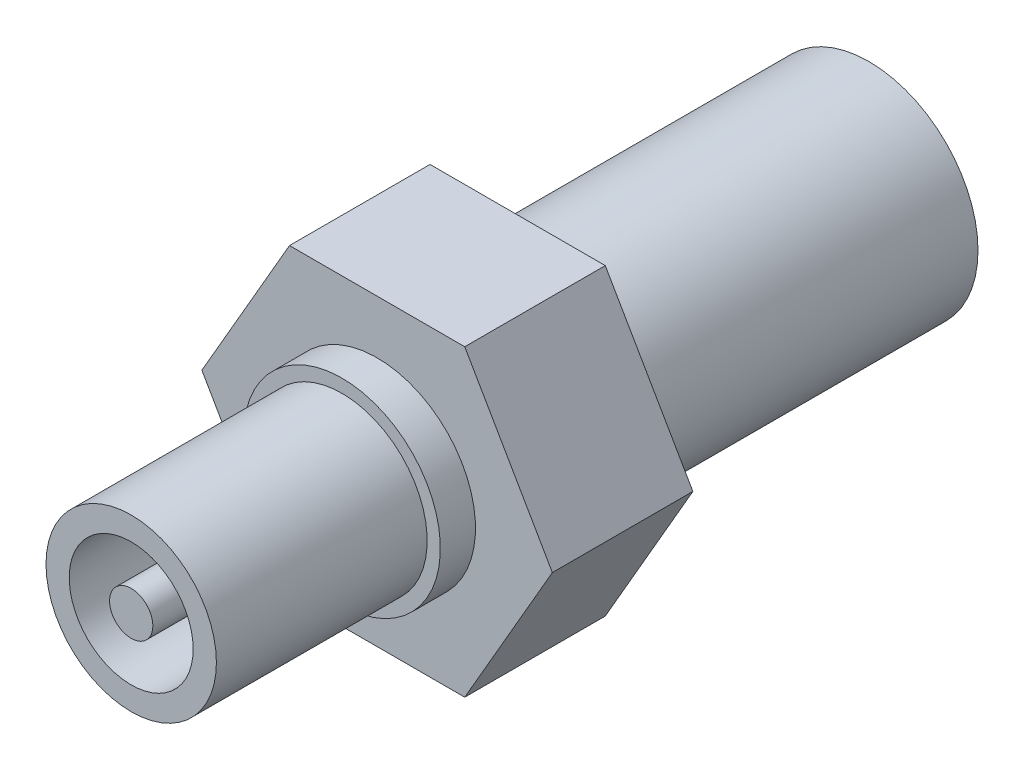
ISO-10303-21;
HEADER;
FILE_DESCRIPTION(('STEP AP214'),'2;1');
FILE_NAME('part.step','',(''),(''),'','','');
FILE_SCHEMA(('AUTOMOTIVE_DESIGN { 1 0 10303 214 1 1 1 1 }'));
ENDSEC;
DATA;
#1=APPLICATION_CONTEXT('core data for automotive mechanical design processes');
#2=APPLICATION_PROTOCOL_DEFINITION('international standard','automotive_design',2000,#1);
#3=PRODUCT_CONTEXT('',#1,'mechanical');
#4=PRODUCT('Part','Part','',(#3));
#5=PRODUCT_RELATED_PRODUCT_CATEGORY('part','',(#4));
#6=PRODUCT_DEFINITION_FORMATION('','',#4);
#7=PRODUCT_DEFINITION_CONTEXT('part definition',#1,'design');
#8=PRODUCT_DEFINITION('design','',#6,#7);
#9=PRODUCT_DEFINITION_SHAPE('','',#8);
#10=(LENGTH_UNIT() NAMED_UNIT(*) SI_UNIT(.MILLI.,.METRE.));
#11=(NAMED_UNIT(*) PLANE_ANGLE_UNIT() SI_UNIT($,.RADIAN.));
#12=(NAMED_UNIT(*) SI_UNIT($,.STERADIAN.) SOLID_ANGLE_UNIT());
#13=UNCERTAINTY_MEASURE_WITH_UNIT(LENGTH_MEASURE(1.E-05),#10,'distance_accuracy_value','');
#14=(GEOMETRIC_REPRESENTATION_CONTEXT(3) GLOBAL_UNCERTAINTY_ASSIGNED_CONTEXT((#13)) GLOBAL_UNIT_ASSIGNED_CONTEXT((#10,
#11,#12)) REPRESENTATION_CONTEXT('',''));
#15=CARTESIAN_POINT('',(0.,0.,0.));
#16=DIRECTION('',(0.,0.,1.));
#17=DIRECTION('',(1.,0.,0.));
#18=AXIS2_PLACEMENT_3D('',#15,#16,#17);
#19=CARTESIAN_POINT('',(3.95946814610245,6.858,-7.9375));
#20=DIRECTION('',(0.,0.,1.));
#21=DIRECTION('',(1.,0.,0.));
#22=AXIS2_PLACEMENT_3D('',#19,#20,#21);
#23=PLANE('',#22);
#24=DIRECTION('',(0.5,-0.866025403784439,0.));
#25=VECTOR('',#24,1.);
#26=CARTESIAN_POINT('',(7.91893629220491,0.,-7.9375));
#27=LINE('',#26,#25);
#28=CARTESIAN_POINT('',(3.95946814610245,6.858,-7.9375));
#29=VERTEX_POINT('',#28);
#30=CARTESIAN_POINT('',(7.91893629220491,0.,-7.9375));
#31=VERTEX_POINT('',#30);
#32=EDGE_CURVE('E124',#29,#31,#27,.T.);
#33=ORIENTED_EDGE('',*,*,#32,.T.);
#34=DIRECTION('',(-0.5,-0.866025403784439,0.));
#35=VECTOR('',#34,1.);
#36=CARTESIAN_POINT('',(3.95946814610245,-6.858,-7.9375));
#37=LINE('',#36,#35);
#38=CARTESIAN_POINT('',(3.95946814610245,-6.858,-7.9375));
#39=VERTEX_POINT('',#38);
#40=EDGE_CURVE('E101',#31,#39,#37,.T.);
#41=ORIENTED_EDGE('',*,*,#40,.T.);
#42=DIRECTION('',(-1.,0.,0.));
#43=VECTOR('',#42,1.);
#44=CARTESIAN_POINT('',(-3.95946814610245,-6.858,-7.9375));
#45=LINE('',#44,#43);
#46=CARTESIAN_POINT('',(-3.95946814610245,-6.858,-7.9375));
#47=VERTEX_POINT('',#46);
#48=EDGE_CURVE('E127',#39,#47,#45,.T.);
#49=ORIENTED_EDGE('',*,*,#48,.T.);
#50=DIRECTION('',(-0.5,0.866025403784439,0.));
#51=VECTOR('',#50,1.);
#52=CARTESIAN_POINT('',(-7.91893629220491,0.,-7.9375));
#53=LINE('',#52,#51);
#54=CARTESIAN_POINT('',(-7.91893629220491,0.,-7.9375));
#55=VERTEX_POINT('',#54);
#56=EDGE_CURVE('E129',#47,#55,#53,.T.);
#57=ORIENTED_EDGE('',*,*,#56,.T.);
#58=DIRECTION('',(0.5,0.866025403784439,0.));
#59=VECTOR('',#58,1.);
#60=CARTESIAN_POINT('',(-3.95946814610246,6.858,-7.9375));
#61=LINE('',#60,#59);
#62=CARTESIAN_POINT('',(-3.95946814610246,6.858,-7.9375));
#63=VERTEX_POINT('',#62);
#64=EDGE_CURVE('E52',#55,#63,#61,.T.);
#65=ORIENTED_EDGE('',*,*,#64,.T.);
#66=DIRECTION('',(1.,0.,0.));
#67=VECTOR('',#66,1.);
#68=CARTESIAN_POINT('',(3.95946814610245,6.858,-7.9375));
#69=LINE('',#68,#67);
#70=EDGE_CURVE('E47',#63,#29,#69,.T.);
#71=ORIENTED_EDGE('',*,*,#70,.T.);
#72=EDGE_LOOP('',(#33,#41,#49,#57,#65,#71));
#73=FACE_BOUND('',#72,.T.);
#74=CARTESIAN_POINT('',(0.,0.,-7.9375));
#75=DIRECTION('',(0.,0.,1.));
#76=DIRECTION('',(1.,0.,0.));
#77=AXIS2_PLACEMENT_3D('',#74,#75,#76);
#78=CIRCLE('',#77,4.9276);
#79=CARTESIAN_POINT('',(4.9276,0.,-7.9375));
#80=VERTEX_POINT('',#79);
#81=EDGE_CURVE('E11',#80,#80,#78,.F.);
#82=ORIENTED_EDGE('',*,*,#81,.F.);
#83=EDGE_LOOP('',(#82));
#84=FACE_BOUND('',#83,.T.);
#85=ADVANCED_FACE('F32',(#73,#84),#23,.F.);
#86=CARTESIAN_POINT('',(0.,0.,9.525));
#87=DIRECTION('',(0.,0.,-1.));
#88=DIRECTION('',(-1.,0.,0.));
#89=AXIS2_PLACEMENT_3D('',#86,#87,#88);
#90=CYLINDRICAL_SURFACE('',#89,3.85);
#91=CARTESIAN_POINT('',(0.,0.,9.525));
#92=DIRECTION('',(0.,0.,1.));
#93=DIRECTION('',(1.,0.,0.));
#94=AXIS2_PLACEMENT_3D('',#91,#92,#93);
#95=CIRCLE('',#94,3.85);
#96=CARTESIAN_POINT('',(3.85,0.,9.525));
#97=VERTEX_POINT('',#96);
#98=EDGE_CURVE('E40',#97,#97,#95,.T.);
#99=ORIENTED_EDGE('',*,*,#98,.F.);
#100=EDGE_LOOP('',(#99));
#101=FACE_BOUND('',#100,.T.);
#102=CARTESIAN_POINT('',(0.,0.,0.));
#103=DIRECTION('',(0.,0.,-1.));
#104=DIRECTION('',(-1.,0.,0.));
#105=AXIS2_PLACEMENT_3D('',#102,#103,#104);
#106=CIRCLE('',#105,3.85);
#107=CARTESIAN_POINT('',(-3.85,0.,0.));
#108=VERTEX_POINT('',#107);
#109=EDGE_CURVE('E149',#108,#108,#106,.T.);
#110=ORIENTED_EDGE('',*,*,#109,.F.);
#111=EDGE_LOOP('',(#110));
#112=FACE_BOUND('',#111,.T.);
#113=ADVANCED_FACE('F34',(#101,#112),#90,.T.);
#114=CARTESIAN_POINT('',(0.,0.,9.525));
#115=DIRECTION('',(0.,0.,1.));
#116=DIRECTION('',(1.,0.,0.));
#117=AXIS2_PLACEMENT_3D('',#114,#115,#116);
#118=PLANE('',#117);
#119=CARTESIAN_POINT('',(0.,0.,9.525));
#120=DIRECTION('',(0.,0.,1.));
#121=DIRECTION('',(1.,0.,0.));
#122=AXIS2_PLACEMENT_3D('',#119,#120,#121);
#123=CIRCLE('',#122,2.80042077962707);
#124=CARTESIAN_POINT('',(2.80042077962707,0.,9.525));
#125=VERTEX_POINT('',#124);
#126=EDGE_CURVE('E337',#125,#125,#123,.T.);
#127=ORIENTED_EDGE('',*,*,#126,.F.);
#128=EDGE_LOOP('',(#127));
#129=FACE_BOUND('',#128,.T.);
#130=ORIENTED_EDGE('',*,*,#98,.T.);
#131=EDGE_LOOP('',(#130));
#132=FACE_BOUND('',#131,.T.);
#133=ADVANCED_FACE('F154',(#129,#132),#118,.T.);
#134=CARTESIAN_POINT('',(0.,0.,0.));
#135=DIRECTION('',(0.,0.,-1.));
#136=DIRECTION('',(-1.,0.,0.));
#137=AXIS2_PLACEMENT_3D('',#134,#135,#136);
#138=PLANE('',#137);
#139=CARTESIAN_POINT('',(0.,0.,0.));
#140=DIRECTION('',(0.,0.,-1.));
#141=DIRECTION('',(-1.,0.,0.));
#142=AXIS2_PLACEMENT_3D('',#139,#140,#141);
#143=CIRCLE('',#142,4.445);
#144=CARTESIAN_POINT('',(-4.445,0.,0.));
#145=VERTEX_POINT('',#144);
#146=EDGE_CURVE('E104',#145,#145,#143,.T.);
#147=ORIENTED_EDGE('',*,*,#146,.F.);
#148=EDGE_LOOP('',(#147));
#149=FACE_BOUND('',#148,.T.);
#150=ORIENTED_EDGE('',*,*,#109,.T.);
#151=EDGE_LOOP('',(#150));
#152=FACE_BOUND('',#151,.T.);
#153=ADVANCED_FACE('F160',(#149,#152),#138,.F.);
#154=CARTESIAN_POINT('',(0.,0.,-1.5875));
#155=DIRECTION('',(0.,0.,1.));
#156=DIRECTION('',(1.,0.,0.));
#157=AXIS2_PLACEMENT_3D('',#154,#155,#156);
#158=CYLINDRICAL_SURFACE('',#157,4.445);
#159=CARTESIAN_POINT('',(0.,0.,-1.5875));
#160=DIRECTION('',(0.,0.,-1.));
#161=DIRECTION('',(-1.,0.,0.));
#162=AXIS2_PLACEMENT_3D('',#159,#160,#161);
#163=CIRCLE('',#162,4.445);
#164=CARTESIAN_POINT('',(-4.445,0.,-1.5875));
#165=VERTEX_POINT('',#164);
#166=EDGE_CURVE('E146',#165,#165,#163,.T.);
#167=ORIENTED_EDGE('',*,*,#166,.F.);
#168=EDGE_LOOP('',(#167));
#169=FACE_BOUND('',#168,.T.);
#170=ORIENTED_EDGE('',*,*,#146,.T.);
#171=EDGE_LOOP('',(#170));
#172=FACE_BOUND('',#171,.T.);
#173=ADVANCED_FACE('F162',(#169,#172),#158,.T.);
#174=CARTESIAN_POINT('',(3.95946814610245,6.858,-1.5875));
#175=DIRECTION('',(0.,0.,1.));
#176=DIRECTION('',(1.,0.,0.));
#177=AXIS2_PLACEMENT_3D('',#174,#175,#176);
#178=PLANE('',#177);
#179=DIRECTION('',(0.5,-0.866025403784439,0.));
#180=VECTOR('',#179,1.);
#181=CARTESIAN_POINT('',(7.91893629220491,0.,-1.5875));
#182=LINE('',#181,#180);
#183=CARTESIAN_POINT('',(3.95946814610245,6.858,-1.5875));
#184=VERTEX_POINT('',#183);
#185=CARTESIAN_POINT('',(7.91893629220491,0.,-1.5875));
#186=VERTEX_POINT('',#185);
#187=EDGE_CURVE('E91',#184,#186,#182,.T.);
#188=ORIENTED_EDGE('',*,*,#187,.F.);
#189=DIRECTION('',(1.,0.,0.));
#190=VECTOR('',#189,1.);
#191=CARTESIAN_POINT('',(3.95946814610245,6.858,-1.5875));
#192=LINE('',#191,#190);
#193=CARTESIAN_POINT('',(-3.95946814610246,6.858,-1.5875));
#194=VERTEX_POINT('',#193);
#195=EDGE_CURVE('E122',#194,#184,#192,.T.);
#196=ORIENTED_EDGE('',*,*,#195,.F.);
#197=DIRECTION('',(0.5,0.866025403784439,0.));
#198=VECTOR('',#197,1.);
#199=CARTESIAN_POINT('',(-3.95946814610246,6.858,-1.5875));
#200=LINE('',#199,#198);
#201=CARTESIAN_POINT('',(-7.91893629220491,0.,-1.5875));
#202=VERTEX_POINT('',#201);
#203=EDGE_CURVE('E120',#202,#194,#200,.T.);
#204=ORIENTED_EDGE('',*,*,#203,.F.);
#205=DIRECTION('',(-0.5,0.866025403784439,0.));
#206=VECTOR('',#205,1.);
#207=CARTESIAN_POINT('',(-7.91893629220491,0.,-1.5875));
#208=LINE('',#207,#206);
#209=CARTESIAN_POINT('',(-3.95946814610245,-6.858,-1.5875));
#210=VERTEX_POINT('',#209);
#211=EDGE_CURVE('E118',#210,#202,#208,.T.);
#212=ORIENTED_EDGE('',*,*,#211,.F.);
#213=DIRECTION('',(-1.,0.,0.));
#214=VECTOR('',#213,1.);
#215=CARTESIAN_POINT('',(-3.95946814610245,-6.858,-1.5875));
#216=LINE('',#215,#214);
#217=CARTESIAN_POINT('',(3.95946814610245,-6.858,-1.5875));
#218=VERTEX_POINT('',#217);
#219=EDGE_CURVE('E93',#218,#210,#216,.T.);
#220=ORIENTED_EDGE('',*,*,#219,.F.);
#221=DIRECTION('',(-0.5,-0.866025403784439,0.));
#222=VECTOR('',#221,1.);
#223=CARTESIAN_POINT('',(3.95946814610245,-6.858,-1.5875));
#224=LINE('',#223,#222);
#225=EDGE_CURVE('E85',#186,#218,#224,.T.);
#226=ORIENTED_EDGE('',*,*,#225,.F.);
#227=EDGE_LOOP('',(#188,#196,#204,#212,#220,#226));
#228=FACE_BOUND('',#227,.T.);
#229=ORIENTED_EDGE('',*,*,#166,.T.);
#230=EDGE_LOOP('',(#229));
#231=FACE_BOUND('',#230,.T.);
#232=ADVANCED_FACE('F87',(#228,#231),#178,.T.);
#233=CARTESIAN_POINT('',(7.91893629220491,0.,-7.9375));
#234=DIRECTION('',(-0.866025403784439,-0.5,0.));
#235=DIRECTION('',(0.5,-0.866025403784439,0.));
#236=AXIS2_PLACEMENT_3D('',#233,#234,#235);
#237=PLANE('',#236);
#238=ORIENTED_EDGE('',*,*,#187,.T.);
#239=DIRECTION('',(0.,0.,1.));
#240=VECTOR('',#239,1.);
#241=CARTESIAN_POINT('',(7.91893629220491,0.,-7.9375));
#242=LINE('',#241,#240);
#243=EDGE_CURVE('E99',#31,#186,#242,.T.);
#244=ORIENTED_EDGE('',*,*,#243,.F.);
#245=ORIENTED_EDGE('',*,*,#32,.F.);
#246=DIRECTION('',(0.,0.,1.));
#247=VECTOR('',#246,1.);
#248=CARTESIAN_POINT('',(3.95946814610245,6.858,-7.9375));
#249=LINE('',#248,#247);
#250=EDGE_CURVE('E109',#29,#184,#249,.T.);
#251=ORIENTED_EDGE('',*,*,#250,.T.);
#252=EDGE_LOOP('',(#238,#244,#245,#251));
#253=FACE_BOUND('',#252,.T.);
#254=ADVANCED_FACE('F108',(#253),#237,.F.);
#255=CARTESIAN_POINT('',(3.95946814610245,-6.858,-7.9375));
#256=DIRECTION('',(-0.866025403784439,0.5,0.));
#257=DIRECTION('',(-0.5,-0.866025403784439,0.));
#258=AXIS2_PLACEMENT_3D('',#255,#256,#257);
#259=PLANE('',#258);
#260=ORIENTED_EDGE('',*,*,#225,.T.);
#261=DIRECTION('',(0.,0.,1.));
#262=VECTOR('',#261,1.);
#263=CARTESIAN_POINT('',(3.95946814610245,-6.858,-7.9375));
#264=LINE('',#263,#262);
#265=EDGE_CURVE('E105',#39,#218,#264,.T.);
#266=ORIENTED_EDGE('',*,*,#265,.F.);
#267=ORIENTED_EDGE('',*,*,#40,.F.);
#268=ORIENTED_EDGE('',*,*,#243,.T.);
#269=EDGE_LOOP('',(#260,#266,#267,#268));
#270=FACE_BOUND('',#269,.T.);
#271=ADVANCED_FACE('F100',(#270),#259,.F.);
#272=CARTESIAN_POINT('',(-3.95946814610245,-6.858,-7.9375));
#273=DIRECTION('',(0.,1.,0.));
#274=DIRECTION('',(0.,0.,1.));
#275=AXIS2_PLACEMENT_3D('',#272,#273,#274);
#276=PLANE('',#275);
#277=ORIENTED_EDGE('',*,*,#219,.T.);
#278=DIRECTION('',(0.,0.,1.));
#279=VECTOR('',#278,1.);
#280=CARTESIAN_POINT('',(-3.95946814610245,-6.858,-7.9375));
#281=LINE('',#280,#279);
#282=EDGE_CURVE('E140',#47,#210,#281,.T.);
#283=ORIENTED_EDGE('',*,*,#282,.F.);
#284=ORIENTED_EDGE('',*,*,#48,.F.);
#285=ORIENTED_EDGE('',*,*,#265,.T.);
#286=EDGE_LOOP('',(#277,#283,#284,#285));
#287=FACE_BOUND('',#286,.T.);
#288=ADVANCED_FACE('F195',(#287),#276,.F.);
#289=CARTESIAN_POINT('',(-7.91893629220491,0.,-7.9375));
#290=DIRECTION('',(0.866025403784439,0.5,0.));
#291=DIRECTION('',(-0.5,0.866025403784439,0.));
#292=AXIS2_PLACEMENT_3D('',#289,#290,#291);
#293=PLANE('',#292);
#294=ORIENTED_EDGE('',*,*,#211,.T.);
#295=DIRECTION('',(0.,0.,1.));
#296=VECTOR('',#295,1.);
#297=CARTESIAN_POINT('',(-7.91893629220491,0.,-7.9375));
#298=LINE('',#297,#296);
#299=EDGE_CURVE('E137',#55,#202,#298,.T.);
#300=ORIENTED_EDGE('',*,*,#299,.F.);
#301=ORIENTED_EDGE('',*,*,#56,.F.);
#302=ORIENTED_EDGE('',*,*,#282,.T.);
#303=EDGE_LOOP('',(#294,#300,#301,#302));
#304=FACE_BOUND('',#303,.T.);
#305=ADVANCED_FACE('F191',(#304),#293,.F.);
#306=CARTESIAN_POINT('',(-3.95946814610246,6.858,-7.9375));
#307=DIRECTION('',(0.866025403784439,-0.5,0.));
#308=DIRECTION('',(0.5,0.866025403784439,0.));
#309=AXIS2_PLACEMENT_3D('',#306,#307,#308);
#310=PLANE('',#309);
#311=ORIENTED_EDGE('',*,*,#203,.T.);
#312=DIRECTION('',(0.,0.,1.));
#313=VECTOR('',#312,1.);
#314=CARTESIAN_POINT('',(-3.95946814610246,6.858,-7.9375));
#315=LINE('',#314,#313);
#316=EDGE_CURVE('E134',#63,#194,#315,.T.);
#317=ORIENTED_EDGE('',*,*,#316,.F.);
#318=ORIENTED_EDGE('',*,*,#64,.F.);
#319=ORIENTED_EDGE('',*,*,#299,.T.);
#320=EDGE_LOOP('',(#311,#317,#318,#319));
#321=FACE_BOUND('',#320,.T.);
#322=ADVANCED_FACE('F187',(#321),#310,.F.);
#323=CARTESIAN_POINT('',(3.95946814610245,6.858,-7.9375));
#324=DIRECTION('',(0.,-1.,0.));
#325=DIRECTION('',(0.,0.,-1.));
#326=AXIS2_PLACEMENT_3D('',#323,#324,#325);
#327=PLANE('',#326);
#328=ORIENTED_EDGE('',*,*,#195,.T.);
#329=ORIENTED_EDGE('',*,*,#250,.F.);
#330=ORIENTED_EDGE('',*,*,#70,.F.);
#331=ORIENTED_EDGE('',*,*,#316,.T.);
#332=EDGE_LOOP('',(#328,#329,#330,#331));
#333=FACE_BOUND('',#332,.T.);
#334=ADVANCED_FACE('F183',(#333),#327,.F.);
#335=CARTESIAN_POINT('',(0.,0.,-23.8125));
#336=DIRECTION('',(0.,0.,1.));
#337=DIRECTION('',(1.,0.,0.));
#338=AXIS2_PLACEMENT_3D('',#335,#336,#337);
#339=CYLINDRICAL_SURFACE('',#338,4.9276);
#340=CARTESIAN_POINT('',(0.,0.,-23.8125));
#341=DIRECTION('',(0.,0.,-1.));
#342=DIRECTION('',(-1.,0.,0.));
#343=AXIS2_PLACEMENT_3D('',#340,#341,#342);
#344=CIRCLE('',#343,4.9276);
#345=CARTESIAN_POINT('',(-4.9276,0.,-23.8125));
#346=VERTEX_POINT('',#345);
#347=EDGE_CURVE('E110',#346,#346,#344,.T.);
#348=ORIENTED_EDGE('',*,*,#347,.F.);
#349=EDGE_LOOP('',(#348));
#350=FACE_BOUND('',#349,.T.);
#351=ORIENTED_EDGE('',*,*,#81,.T.);
#352=EDGE_LOOP('',(#351));
#353=FACE_BOUND('',#352,.T.);
#354=ADVANCED_FACE('F186',(#350,#353),#339,.T.);
#355=CARTESIAN_POINT('',(0.,0.,-23.8125));
#356=DIRECTION('',(0.,0.,-1.));
#357=DIRECTION('',(-1.,0.,0.));
#358=AXIS2_PLACEMENT_3D('',#355,#356,#357);
#359=PLANE('',#358);
#360=ORIENTED_EDGE('',*,*,#347,.T.);
#361=EDGE_LOOP('',(#360));
#362=FACE_BOUND('',#361,.T.);
#363=ADVANCED_FACE('F233',(#362),#359,.T.);
#364=CARTESIAN_POINT('',(0.,0.,0.));
#365=DIRECTION('',(0.,0.,1.));
#366=DIRECTION('',(1.,0.,0.));
#367=AXIS2_PLACEMENT_3D('',#364,#365,#366);
#368=CYLINDRICAL_SURFACE('',#367,2.80042077962707);
#369=CARTESIAN_POINT('',(0.,0.,0.));
#370=DIRECTION('',(0.,0.,1.));
#371=DIRECTION('',(1.,0.,0.));
#372=AXIS2_PLACEMENT_3D('',#369,#370,#371);
#373=CIRCLE('',#372,2.80042077962707);
#374=CARTESIAN_POINT('',(2.80042077962707,0.,0.));
#375=VERTEX_POINT('',#374);
#376=EDGE_CURVE('E113',#375,#375,#373,.T.);
#377=ORIENTED_EDGE('',*,*,#376,.F.);
#378=EDGE_LOOP('',(#377));
#379=FACE_BOUND('',#378,.T.);
#380=ORIENTED_EDGE('',*,*,#126,.T.);
#381=EDGE_LOOP('',(#380));
#382=FACE_BOUND('',#381,.T.);
#383=ADVANCED_FACE('F238',(#379,#382),#368,.F.);
#384=CARTESIAN_POINT('',(0.,0.,0.));
#385=DIRECTION('',(0.,0.,1.));
#386=DIRECTION('',(1.,0.,0.));
#387=AXIS2_PLACEMENT_3D('',#384,#385,#386);
#388=PLANE('',#387);
#389=CARTESIAN_POINT('',(0.,0.,0.));
#390=DIRECTION('',(0.,0.,1.));
#391=DIRECTION('',(1.,0.,0.));
#392=AXIS2_PLACEMENT_3D('',#389,#390,#391);
#393=CIRCLE('',#392,0.97787641963701);
#394=CARTESIAN_POINT('',(0.97787641963701,0.,0.));
#395=VERTEX_POINT('',#394);
#396=EDGE_CURVE('E334',#395,#395,#393,.T.);
#397=ORIENTED_EDGE('',*,*,#396,.F.);
#398=EDGE_LOOP('',(#397));
#399=FACE_BOUND('',#398,.T.);
#400=ORIENTED_EDGE('',*,*,#376,.T.);
#401=EDGE_LOOP('',(#400));
#402=FACE_BOUND('',#401,.T.);
#403=ADVANCED_FACE('F243',(#399,#402),#388,.T.);
#404=CARTESIAN_POINT('',(0.,0.,0.));
#405=DIRECTION('',(0.,0.,1.));
#406=DIRECTION('',(1.,0.,0.));
#407=AXIS2_PLACEMENT_3D('',#404,#405,#406);
#408=CYLINDRICAL_SURFACE('',#407,0.97787641963701);
#409=ORIENTED_EDGE('',*,*,#396,.T.);
#410=EDGE_LOOP('',(#409));
#411=FACE_BOUND('',#410,.T.);
#412=CARTESIAN_POINT('',(0.,0.,9.525));
#413=DIRECTION('',(0.,0.,1.));
#414=DIRECTION('',(1.,0.,0.));
#415=AXIS2_PLACEMENT_3D('',#412,#413,#414);
#416=CIRCLE('',#415,0.97787641963701);
#417=CARTESIAN_POINT('',(0.97787641963701,0.,9.525));
#418=VERTEX_POINT('',#417);
#419=EDGE_CURVE('E332',#418,#418,#416,.T.);
#420=ORIENTED_EDGE('',*,*,#419,.F.);
#421=EDGE_LOOP('',(#420));
#422=FACE_BOUND('',#421,.T.);
#423=ADVANCED_FACE('F254',(#411,#422),#408,.T.);
#424=ORIENTED_EDGE('',*,*,#419,.T.);
#425=EDGE_LOOP('',(#424));
#426=FACE_BOUND('',#425,.T.);
#427=ADVANCED_FACE('F172',(#426),#118,.T.);
#428=CLOSED_SHELL('',(#85,#113,#133,#153,#173,#232,#254,#271,#288,#305,#322,#334,#354,#363,#383,
#403,#423,#427));
#429=MANIFOLD_SOLID_BREP('B2',#428);
#430=ADVANCED_BREP_SHAPE_REPRESENTATION('',(#18,#429),#14);
#431=SHAPE_DEFINITION_REPRESENTATION(#9,#430);
ENDSEC;
END-ISO-10303-21;
